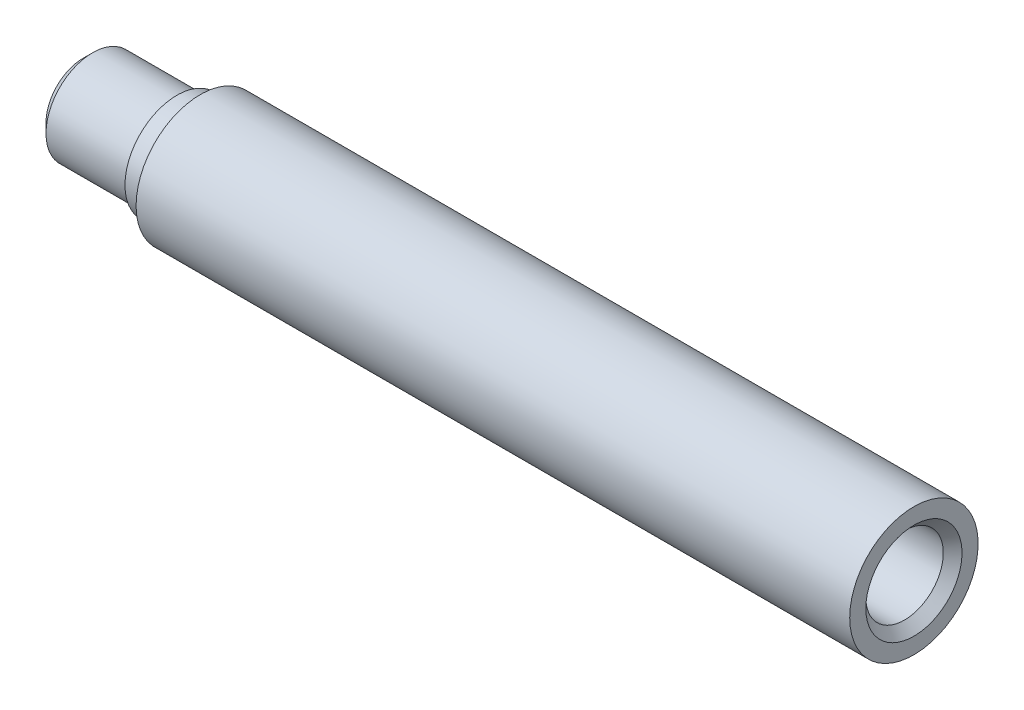
ISO-10303-21;
HEADER;
FILE_DESCRIPTION(('STEP AP214'),'2;1');
FILE_NAME('part.step','',(''),(''),'','','');
FILE_SCHEMA(('AUTOMOTIVE_DESIGN { 1 0 10303 214 1 1 1 1 }'));
ENDSEC;
DATA;
#1=APPLICATION_CONTEXT('core data for automotive mechanical design processes');
#2=APPLICATION_PROTOCOL_DEFINITION('international standard','automotive_design',2000,#1);
#3=PRODUCT_CONTEXT('',#1,'mechanical');
#4=PRODUCT('Part','Part','',(#3));
#5=PRODUCT_RELATED_PRODUCT_CATEGORY('part','',(#4));
#6=PRODUCT_DEFINITION_FORMATION('','',#4);
#7=PRODUCT_DEFINITION_CONTEXT('part definition',#1,'design');
#8=PRODUCT_DEFINITION('design','',#6,#7);
#9=PRODUCT_DEFINITION_SHAPE('','',#8);
#10=(LENGTH_UNIT() NAMED_UNIT(*) SI_UNIT(.MILLI.,.METRE.));
#11=(NAMED_UNIT(*) PLANE_ANGLE_UNIT() SI_UNIT($,.RADIAN.));
#12=(NAMED_UNIT(*) SI_UNIT($,.STERADIAN.) SOLID_ANGLE_UNIT());
#13=UNCERTAINTY_MEASURE_WITH_UNIT(LENGTH_MEASURE(1.E-05),#10,'distance_accuracy_value','');
#14=(GEOMETRIC_REPRESENTATION_CONTEXT(3) GLOBAL_UNCERTAINTY_ASSIGNED_CONTEXT((#13)) GLOBAL_UNIT_ASSIGNED_CONTEXT((#10,
#11,#12)) REPRESENTATION_CONTEXT('',''));
#15=CARTESIAN_POINT('',(0.,0.,0.));
#16=DIRECTION('',(0.,0.,1.));
#17=DIRECTION('',(1.,0.,0.));
#18=AXIS2_PLACEMENT_3D('',#15,#16,#17);
#19=CARTESIAN_POINT('',(35.,0.,0.));
#20=DIRECTION('',(-1.,0.,0.));
#21=DIRECTION('',(0.,0.,1.));
#22=AXIS2_PLACEMENT_3D('',#19,#20,#21);
#23=CYLINDRICAL_SURFACE('',#22,3.311374294);
#24=CARTESIAN_POINT('',(19.,0.,0.));
#25=DIRECTION('',(-1.,0.,0.));
#26=DIRECTION('',(0.,0.,1.));
#27=AXIS2_PLACEMENT_3D('',#24,#25,#26);
#28=CIRCLE('',#27,3.311374294);
#29=CARTESIAN_POINT('',(19.,0.,3.311374294));
#30=VERTEX_POINT('',#29);
#31=EDGE_CURVE('E11',#30,#30,#28,.T.);
#32=ORIENTED_EDGE('',*,*,#31,.T.);
#33=EDGE_LOOP('',(#32));
#34=FACE_BOUND('',#33,.T.);
#35=CARTESIAN_POINT('',(34.2,0.,0.));
#36=DIRECTION('',(-1.,0.,0.));
#37=DIRECTION('',(0.,0.,1.));
#38=AXIS2_PLACEMENT_3D('',#35,#36,#37);
#39=CIRCLE('',#38,3.311374294);
#40=CARTESIAN_POINT('',(34.2,0.,3.311374294));
#41=VERTEX_POINT('',#40);
#42=EDGE_CURVE('E51',#41,#41,#39,.T.);
#43=ORIENTED_EDGE('',*,*,#42,.F.);
#44=EDGE_LOOP('',(#43));
#45=FACE_BOUND('',#44,.T.);
#46=ADVANCED_FACE('F32',(#34,#45),#23,.F.);
#47=CARTESIAN_POINT('',(19.,0.,0.));
#48=DIRECTION('',(1.,0.,0.));
#49=DIRECTION('',(0.,0.,-1.));
#50=AXIS2_PLACEMENT_3D('',#47,#48,#49);
#51=CONICAL_SURFACE('',#50,3.311374294,1.02974425870434);
#52=CARTESIAN_POINT('',(17.010325592,0.,0.));
#53=VERTEX_POINT('',#52);
#54=VERTEX_LOOP('',#53);
#55=FACE_BOUND('',#54,.T.);
#56=ORIENTED_EDGE('',*,*,#31,.F.);
#57=EDGE_LOOP('',(#56));
#58=FACE_BOUND('',#57,.T.);
#59=ADVANCED_FACE('F41',(#55,#58),#51,.F.);
#60=CARTESIAN_POINT('',(-36.,0.,0.));
#61=DIRECTION('',(-1.,0.,0.));
#62=DIRECTION('',(0.,0.,1.));
#63=AXIS2_PLACEMENT_3D('',#60,#61,#62);
#64=PLANE('',#63);
#65=CARTESIAN_POINT('',(-36.,0.,0.));
#66=DIRECTION('',(-1.,0.,0.));
#67=DIRECTION('',(0.,0.,1.));
#68=AXIS2_PLACEMENT_3D('',#65,#66,#67);
#69=CIRCLE('',#68,3.18787429399997);
#70=CARTESIAN_POINT('',(-36.,0.,3.18787429399997));
#71=VERTEX_POINT('',#70);
#72=EDGE_CURVE('E38',#71,#71,#69,.T.);
#73=ORIENTED_EDGE('',*,*,#72,.T.);
#74=EDGE_LOOP('',(#73));
#75=FACE_BOUND('',#74,.T.);
#76=ADVANCED_FACE('F44',(#75),#64,.T.);
#77=CARTESIAN_POINT('',(-36.,0.,0.));
#78=DIRECTION('',(1.,0.,0.));
#79=DIRECTION('',(0.,0.,-1.));
#80=AXIS2_PLACEMENT_3D('',#77,#78,#79);
#81=CONICAL_SURFACE('',#80,3.18787429399997,0.78539816339745);
#82=CARTESIAN_POINT('',(-35.2,0.,0.));
#83=DIRECTION('',(-1.,0.,0.));
#84=DIRECTION('',(0.,0.,1.));
#85=AXIS2_PLACEMENT_3D('',#82,#83,#84);
#86=CIRCLE('',#85,3.987874294);
#87=CARTESIAN_POINT('',(-35.2,0.,3.987874294));
#88=VERTEX_POINT('',#87);
#89=EDGE_CURVE('E73',#88,#88,#86,.T.);
#90=ORIENTED_EDGE('',*,*,#89,.T.);
#91=EDGE_LOOP('',(#90));
#92=FACE_BOUND('',#91,.T.);
#93=ORIENTED_EDGE('',*,*,#72,.F.);
#94=EDGE_LOOP('',(#93));
#95=FACE_BOUND('',#94,.T.);
#96=ADVANCED_FACE('F79',(#92,#95),#81,.T.);
#97=CARTESIAN_POINT('',(35.,0.,0.));
#98=DIRECTION('',(-1.,0.,0.));
#99=DIRECTION('',(0.,0.,1.));
#100=AXIS2_PLACEMENT_3D('',#97,#98,#99);
#101=CYLINDRICAL_SURFACE('',#100,3.987874294);
#102=CARTESIAN_POINT('',(-28.,0.,0.));
#103=DIRECTION('',(-1.,0.,0.));
#104=DIRECTION('',(0.,0.,1.));
#105=AXIS2_PLACEMENT_3D('',#102,#103,#104);
#106=CIRCLE('',#105,3.987874294);
#107=CARTESIAN_POINT('',(-28.,0.,3.987874294));
#108=VERTEX_POINT('',#107);
#109=EDGE_CURVE('E70',#108,#108,#106,.T.);
#110=ORIENTED_EDGE('',*,*,#109,.T.);
#111=EDGE_LOOP('',(#110));
#112=FACE_BOUND('',#111,.T.);
#113=ORIENTED_EDGE('',*,*,#89,.F.);
#114=EDGE_LOOP('',(#113));
#115=FACE_BOUND('',#114,.T.);
#116=ADVANCED_FACE('F81',(#112,#115),#101,.T.);
#117=CARTESIAN_POINT('',(-28.,3.987874294,0.));
#118=DIRECTION('',(-1.,0.,0.));
#119=DIRECTION('',(0.,0.,1.));
#120=AXIS2_PLACEMENT_3D('',#117,#118,#119);
#121=PLANE('',#120);
#122=CARTESIAN_POINT('',(-28.,0.,0.));
#123=DIRECTION('',(-1.,0.,0.));
#124=DIRECTION('',(0.,0.,1.));
#125=AXIS2_PLACEMENT_3D('',#122,#123,#124);
#126=CIRCLE('',#125,4.437874294);
#127=CARTESIAN_POINT('',(-28.,0.,4.437874294));
#128=VERTEX_POINT('',#127);
#129=EDGE_CURVE('E67',#128,#128,#126,.T.);
#130=ORIENTED_EDGE('',*,*,#129,.T.);
#131=EDGE_LOOP('',(#130));
#132=FACE_BOUND('',#131,.T.);
#133=ORIENTED_EDGE('',*,*,#109,.F.);
#134=EDGE_LOOP('',(#133));
#135=FACE_BOUND('',#134,.T.);
#136=ADVANCED_FACE('F88',(#132,#135),#121,.T.);
#137=CARTESIAN_POINT('',(35.,0.,0.));
#138=DIRECTION('',(-1.,0.,0.));
#139=DIRECTION('',(0.,0.,1.));
#140=AXIS2_PLACEMENT_3D('',#137,#138,#139);
#141=CYLINDRICAL_SURFACE('',#140,4.437874294);
#142=CARTESIAN_POINT('',(-26.,0.,0.));
#143=DIRECTION('',(-1.,0.,0.));
#144=DIRECTION('',(0.,0.,1.));
#145=AXIS2_PLACEMENT_3D('',#142,#143,#144);
#146=CIRCLE('',#145,4.437874294);
#147=CARTESIAN_POINT('',(-26.,0.,4.437874294));
#148=VERTEX_POINT('',#147);
#149=EDGE_CURVE('E64',#148,#148,#146,.T.);
#150=ORIENTED_EDGE('',*,*,#149,.T.);
#151=EDGE_LOOP('',(#150));
#152=FACE_BOUND('',#151,.T.);
#153=ORIENTED_EDGE('',*,*,#129,.F.);
#154=EDGE_LOOP('',(#153));
#155=FACE_BOUND('',#154,.T.);
#156=ADVANCED_FACE('F95',(#152,#155),#141,.T.);
#157=CARTESIAN_POINT('',(-26.,4.437874294,0.));
#158=DIRECTION('',(-1.,0.,0.));
#159=DIRECTION('',(0.,0.,1.));
#160=AXIS2_PLACEMENT_3D('',#157,#158,#159);
#161=PLANE('',#160);
#162=CARTESIAN_POINT('',(-26.,0.,0.));
#163=DIRECTION('',(-1.,0.,0.));
#164=DIRECTION('',(0.,0.,1.));
#165=AXIS2_PLACEMENT_3D('',#162,#163,#164);
#166=CIRCLE('',#165,5.487874294);
#167=CARTESIAN_POINT('',(-26.,0.,5.487874294));
#168=VERTEX_POINT('',#167);
#169=EDGE_CURVE('E61',#168,#168,#166,.T.);
#170=ORIENTED_EDGE('',*,*,#169,.T.);
#171=EDGE_LOOP('',(#170));
#172=FACE_BOUND('',#171,.T.);
#173=ORIENTED_EDGE('',*,*,#149,.F.);
#174=EDGE_LOOP('',(#173));
#175=FACE_BOUND('',#174,.T.);
#176=ADVANCED_FACE('F99',(#172,#175),#161,.T.);
#177=CARTESIAN_POINT('',(35.,0.,0.));
#178=DIRECTION('',(-1.,0.,0.));
#179=DIRECTION('',(0.,0.,1.));
#180=AXIS2_PLACEMENT_3D('',#177,#178,#179);
#181=CYLINDRICAL_SURFACE('',#180,5.487874294);
#182=CARTESIAN_POINT('',(35.,0.,0.));
#183=DIRECTION('',(-1.,0.,0.));
#184=DIRECTION('',(0.,0.,1.));
#185=AXIS2_PLACEMENT_3D('',#182,#183,#184);
#186=CIRCLE('',#185,5.487874294);
#187=CARTESIAN_POINT('',(35.,0.,5.487874294));
#188=VERTEX_POINT('',#187);
#189=EDGE_CURVE('E56',#188,#188,#186,.T.);
#190=ORIENTED_EDGE('',*,*,#189,.T.);
#191=EDGE_LOOP('',(#190));
#192=FACE_BOUND('',#191,.T.);
#193=ORIENTED_EDGE('',*,*,#169,.F.);
#194=EDGE_LOOP('',(#193));
#195=FACE_BOUND('',#194,.T.);
#196=ADVANCED_FACE('F103',(#192,#195),#181,.T.);
#197=CARTESIAN_POINT('',(35.,5.487874294,0.));
#198=DIRECTION('',(1.,0.,0.));
#199=DIRECTION('',(0.,0.,-1.));
#200=AXIS2_PLACEMENT_3D('',#197,#198,#199);
#201=PLANE('',#200);
#202=CARTESIAN_POINT('',(35.,0.,0.));
#203=DIRECTION('',(-1.,0.,0.));
#204=DIRECTION('',(0.,0.,1.));
#205=AXIS2_PLACEMENT_3D('',#202,#203,#204);
#206=CIRCLE('',#205,4.11137429400003);
#207=CARTESIAN_POINT('',(35.,0.,4.11137429400003));
#208=VERTEX_POINT('',#207);
#209=EDGE_CURVE('E53',#208,#208,#206,.T.);
#210=ORIENTED_EDGE('',*,*,#209,.T.);
#211=EDGE_LOOP('',(#210));
#212=FACE_BOUND('',#211,.T.);
#213=ORIENTED_EDGE('',*,*,#189,.F.);
#214=EDGE_LOOP('',(#213));
#215=FACE_BOUND('',#214,.T.);
#216=ADVANCED_FACE('F107',(#212,#215),#201,.T.);
#217=CARTESIAN_POINT('',(35.,0.,0.));
#218=DIRECTION('',(1.,0.,0.));
#219=DIRECTION('',(0.,0.,-1.));
#220=AXIS2_PLACEMENT_3D('',#217,#218,#219);
#221=CONICAL_SURFACE('',#220,4.11137429400003,0.785398163397447);
#222=ORIENTED_EDGE('',*,*,#42,.T.);
#223=EDGE_LOOP('',(#222));
#224=FACE_BOUND('',#223,.T.);
#225=ORIENTED_EDGE('',*,*,#209,.F.);
#226=EDGE_LOOP('',(#225));
#227=FACE_BOUND('',#226,.T.);
#228=ADVANCED_FACE('F111',(#224,#227),#221,.F.);
#229=CLOSED_SHELL('',(#46,#59,#76,#96,#116,#136,#156,#176,#196,#216,#228));
#230=MANIFOLD_SOLID_BREP('B2',#229);
#231=ADVANCED_BREP_SHAPE_REPRESENTATION('',(#18,#230),#14);
#232=SHAPE_DEFINITION_REPRESENTATION(#9,#231);
ENDSEC;
END-ISO-10303-21;
